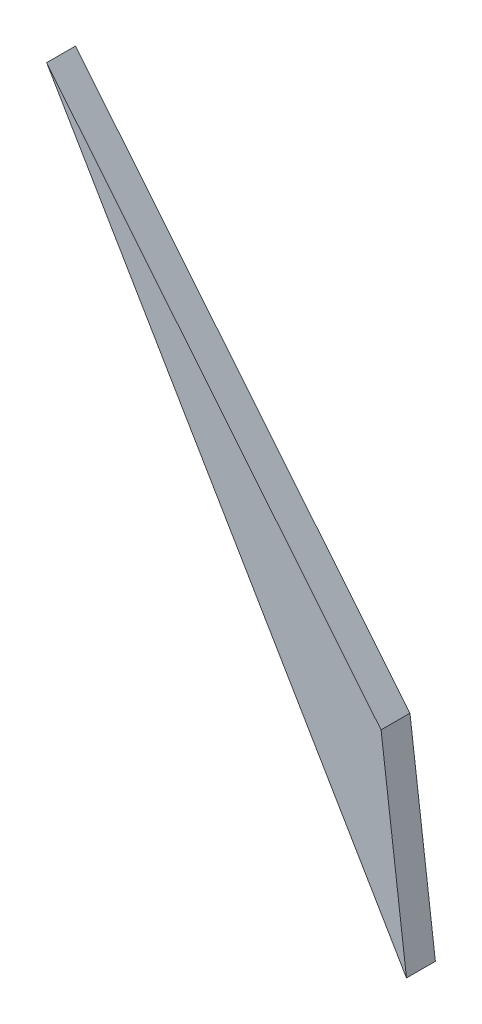
ISO-10303-21;
HEADER;
FILE_DESCRIPTION(('STEP AP214'),'2;1');
FILE_NAME('part.step','',(''),(''),'','','');
FILE_SCHEMA(('AUTOMOTIVE_DESIGN { 1 0 10303 214 1 1 1 1 }'));
ENDSEC;
DATA;
#1=APPLICATION_CONTEXT('core data for automotive mechanical design processes');
#2=APPLICATION_PROTOCOL_DEFINITION('international standard','automotive_design',2000,#1);
#3=PRODUCT_CONTEXT('',#1,'mechanical');
#4=PRODUCT('Part','Part','',(#3));
#5=PRODUCT_RELATED_PRODUCT_CATEGORY('part','',(#4));
#6=PRODUCT_DEFINITION_FORMATION('','',#4);
#7=PRODUCT_DEFINITION_CONTEXT('part definition',#1,'design');
#8=PRODUCT_DEFINITION('design','',#6,#7);
#9=PRODUCT_DEFINITION_SHAPE('','',#8);
#10=(LENGTH_UNIT() NAMED_UNIT(*) SI_UNIT(.MILLI.,.METRE.));
#11=(NAMED_UNIT(*) PLANE_ANGLE_UNIT() SI_UNIT($,.RADIAN.));
#12=(NAMED_UNIT(*) SI_UNIT($,.STERADIAN.) SOLID_ANGLE_UNIT());
#13=UNCERTAINTY_MEASURE_WITH_UNIT(LENGTH_MEASURE(1.E-05),#10,'distance_accuracy_value','');
#14=(GEOMETRIC_REPRESENTATION_CONTEXT(3) GLOBAL_UNCERTAINTY_ASSIGNED_CONTEXT((#13)) GLOBAL_UNIT_ASSIGNED_CONTEXT((#10,
#11,#12)) REPRESENTATION_CONTEXT('',''));
#15=CARTESIAN_POINT('',(0.,0.,0.));
#16=DIRECTION('',(0.,0.,1.));
#17=DIRECTION('',(1.,0.,0.));
#18=AXIS2_PLACEMENT_3D('',#15,#16,#17);
#19=CARTESIAN_POINT('',(-0.229693263885274,-22.2276619821565,3.));
#20=DIRECTION('',(-0.992192735918912,-0.124713971910708,0.));
#21=DIRECTION('',(0.124713971910708,-0.992192735918912,0.));
#22=AXIS2_PLACEMENT_3D('',#19,#20,#21);
#23=PLANE('',#22);
#24=DIRECTION('',(-0.124713971910708,0.992192735918912,0.));
#25=VECTOR('',#24,1.);
#26=CARTESIAN_POINT('',(-0.229693263885274,-22.2276619821565,0.));
#27=LINE('',#26,#25);
#28=CARTESIAN_POINT('',(-0.229693263885274,-22.2276619821565,0.));
#29=VERTEX_POINT('',#28);
#30=CARTESIAN_POINT('',(-2.86929473980145,-1.22766198215649,0.));
#31=VERTEX_POINT('',#30);
#32=EDGE_CURVE('E80',#29,#31,#27,.T.);
#33=ORIENTED_EDGE('',*,*,#32,.T.);
#34=DIRECTION('',(0.,0.,-1.));
#35=VECTOR('',#34,1.);
#36=CARTESIAN_POINT('',(-2.86929473980145,-1.22766198215649,3.));
#37=LINE('',#36,#35);
#38=CARTESIAN_POINT('',(-2.86929473980145,-1.22766198215649,3.));
#39=VERTEX_POINT('',#38);
#40=EDGE_CURVE('E11',#39,#31,#37,.T.);
#41=ORIENTED_EDGE('',*,*,#40,.F.);
#42=DIRECTION('',(-0.124713971910708,0.992192735918912,0.));
#43=VECTOR('',#42,1.);
#44=CARTESIAN_POINT('',(-0.229693263885274,-22.2276619821565,3.));
#45=LINE('',#44,#43);
#46=CARTESIAN_POINT('',(-0.229693263885274,-22.2276619821565,3.));
#47=VERTEX_POINT('',#46);
#48=EDGE_CURVE('E73',#47,#39,#45,.T.);
#49=ORIENTED_EDGE('',*,*,#48,.F.);
#50=DIRECTION('',(0.,0.,-1.));
#51=VECTOR('',#50,1.);
#52=CARTESIAN_POINT('',(-0.229693263885274,-22.2276619821565,3.));
#53=LINE('',#52,#51);
#54=EDGE_CURVE('E81',#47,#29,#53,.T.);
#55=ORIENTED_EDGE('',*,*,#54,.T.);
#56=EDGE_LOOP('',(#33,#41,#49,#55));
#57=FACE_BOUND('',#56,.T.);
#58=ADVANCED_FACE('F33',(#57),#23,.F.);
#59=CARTESIAN_POINT('',(-2.86929473980145,-1.22766198215649,3.));
#60=DIRECTION('',(-0.775338824481745,-0.631545491038663,0.));
#61=DIRECTION('',(0.631545491038663,-0.775338824481745,0.));
#62=AXIS2_PLACEMENT_3D('',#59,#60,#61);
#63=PLANE('',#62);
#64=DIRECTION('',(-0.631545491038663,0.775338824481745,0.));
#65=VECTOR('',#64,1.);
#66=CARTESIAN_POINT('',(-2.86929473980145,-1.22766198215649,0.));
#67=LINE('',#66,#65);
#68=CARTESIAN_POINT('',(-37.6042967469279,41.4159733643395,0.));
#69=VERTEX_POINT('',#68);
#70=EDGE_CURVE('E61',#31,#69,#67,.T.);
#71=ORIENTED_EDGE('',*,*,#70,.T.);
#72=DIRECTION('',(0.,0.,-1.));
#73=VECTOR('',#72,1.);
#74=CARTESIAN_POINT('',(-37.6042967469279,41.4159733643395,3.));
#75=LINE('',#74,#73);
#76=CARTESIAN_POINT('',(-37.6042967469279,41.4159733643395,3.));
#77=VERTEX_POINT('',#76);
#78=EDGE_CURVE('E41',#77,#69,#75,.T.);
#79=ORIENTED_EDGE('',*,*,#78,.F.);
#80=DIRECTION('',(-0.631545491038663,0.775338824481745,0.));
#81=VECTOR('',#80,1.);
#82=CARTESIAN_POINT('',(-2.86929473980145,-1.22766198215649,3.));
#83=LINE('',#82,#81);
#84=EDGE_CURVE('E69',#39,#77,#83,.T.);
#85=ORIENTED_EDGE('',*,*,#84,.F.);
#86=ORIENTED_EDGE('',*,*,#40,.T.);
#87=EDGE_LOOP('',(#71,#79,#85,#86));
#88=FACE_BOUND('',#87,.T.);
#89=ADVANCED_FACE('F70',(#88),#63,.F.);
#90=CARTESIAN_POINT('',(-37.6042967469279,41.4159733643395,3.));
#91=DIRECTION('',(0.862306003239521,0.506387555906623,0.));
#92=DIRECTION('',(-0.506387555906623,0.862306003239521,0.));
#93=AXIS2_PLACEMENT_3D('',#90,#91,#92);
#94=PLANE('',#93);
#95=DIRECTION('',(0.506387555906622,-0.862306003239521,0.));
#96=VECTOR('',#95,1.);
#97=CARTESIAN_POINT('',(-37.6042967469279,41.4159733643395,0.));
#98=LINE('',#97,#96);
#99=EDGE_CURVE('E66',#69,#29,#98,.T.);
#100=ORIENTED_EDGE('',*,*,#99,.T.);
#101=ORIENTED_EDGE('',*,*,#54,.F.);
#102=DIRECTION('',(0.506387555906622,-0.862306003239521,0.));
#103=VECTOR('',#102,1.);
#104=CARTESIAN_POINT('',(-37.6042967469279,41.4159733643395,3.));
#105=LINE('',#104,#103);
#106=EDGE_CURVE('E49',#77,#47,#105,.T.);
#107=ORIENTED_EDGE('',*,*,#106,.F.);
#108=ORIENTED_EDGE('',*,*,#78,.T.);
#109=EDGE_LOOP('',(#100,#101,#107,#108));
#110=FACE_BOUND('',#109,.T.);
#111=ADVANCED_FACE('F88',(#110),#94,.F.);
#112=CARTESIAN_POINT('',(0.,0.,3.));
#113=DIRECTION('',(0.,0.,1.));
#114=DIRECTION('',(1.,0.,0.));
#115=AXIS2_PLACEMENT_3D('',#112,#113,#114);
#116=PLANE('',#115);
#117=ORIENTED_EDGE('',*,*,#48,.T.);
#118=ORIENTED_EDGE('',*,*,#84,.T.);
#119=ORIENTED_EDGE('',*,*,#106,.T.);
#120=EDGE_LOOP('',(#117,#118,#119));
#121=FACE_BOUND('',#120,.T.);
#122=ADVANCED_FACE('F76',(#121),#116,.T.);
#123=CARTESIAN_POINT('',(0.,0.,0.));
#124=DIRECTION('',(0.,0.,1.));
#125=DIRECTION('',(1.,0.,0.));
#126=AXIS2_PLACEMENT_3D('',#123,#124,#125);
#127=PLANE('',#126);
#128=ORIENTED_EDGE('',*,*,#32,.F.);
#129=ORIENTED_EDGE('',*,*,#99,.F.);
#130=ORIENTED_EDGE('',*,*,#70,.F.);
#131=EDGE_LOOP('',(#128,#129,#130));
#132=FACE_BOUND('',#131,.T.);
#133=ADVANCED_FACE('F89',(#132),#127,.F.);
#134=CLOSED_SHELL('',(#58,#89,#111,#122,#133));
#135=MANIFOLD_SOLID_BREP('B2',#134);
#136=ADVANCED_BREP_SHAPE_REPRESENTATION('',(#18,#135),#14);
#137=SHAPE_DEFINITION_REPRESENTATION(#9,#136);
ENDSEC;
END-ISO-10303-21;
